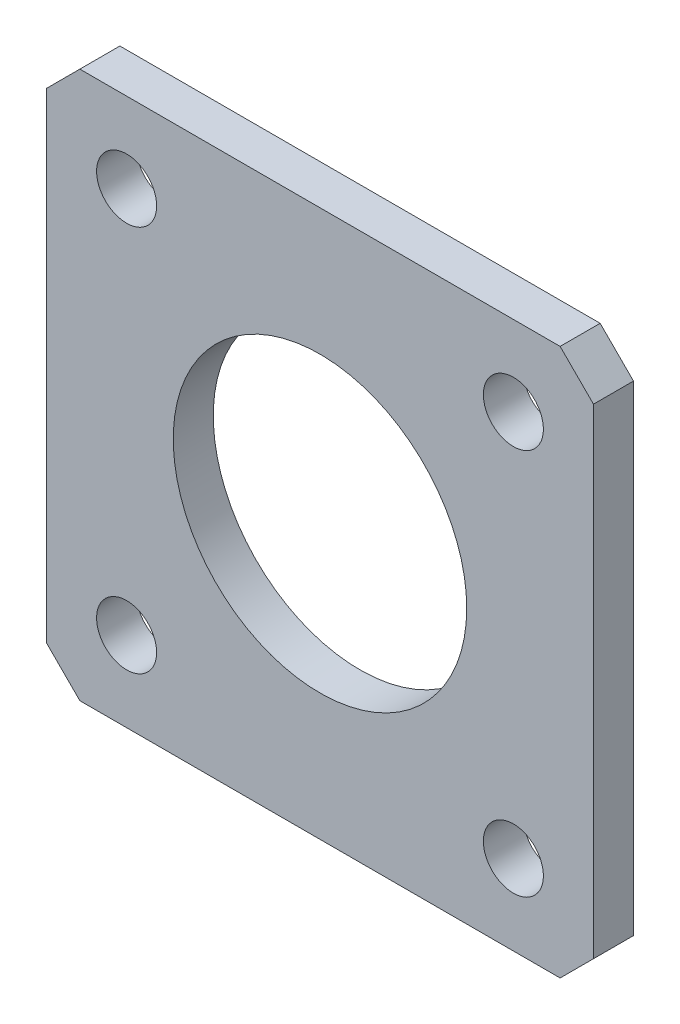
ISO-10303-21;
HEADER;
FILE_DESCRIPTION(('STEP AP214'),'2;1');
FILE_NAME('part.step','',(''),(''),'','','');
FILE_SCHEMA(('AUTOMOTIVE_DESIGN { 1 0 10303 214 1 1 1 1 }'));
ENDSEC;
DATA;
#1=APPLICATION_CONTEXT('core data for automotive mechanical design processes');
#2=APPLICATION_PROTOCOL_DEFINITION('international standard','automotive_design',2000,#1);
#3=PRODUCT_CONTEXT('',#1,'mechanical');
#4=PRODUCT('Part','Part','',(#3));
#5=PRODUCT_RELATED_PRODUCT_CATEGORY('part','',(#4));
#6=PRODUCT_DEFINITION_FORMATION('','',#4);
#7=PRODUCT_DEFINITION_CONTEXT('part definition',#1,'design');
#8=PRODUCT_DEFINITION('design','',#6,#7);
#9=PRODUCT_DEFINITION_SHAPE('','',#8);
#10=(LENGTH_UNIT() NAMED_UNIT(*) SI_UNIT(.MILLI.,.METRE.));
#11=(NAMED_UNIT(*) PLANE_ANGLE_UNIT() SI_UNIT($,.RADIAN.));
#12=(NAMED_UNIT(*) SI_UNIT($,.STERADIAN.) SOLID_ANGLE_UNIT());
#13=UNCERTAINTY_MEASURE_WITH_UNIT(LENGTH_MEASURE(1.E-05),#10,'distance_accuracy_value','');
#14=(GEOMETRIC_REPRESENTATION_CONTEXT(3) GLOBAL_UNCERTAINTY_ASSIGNED_CONTEXT((#13)) GLOBAL_UNIT_ASSIGNED_CONTEXT((#10,
#11,#12)) REPRESENTATION_CONTEXT('',''));
#15=CARTESIAN_POINT('',(0.,0.,0.));
#16=DIRECTION('',(0.,0.,1.));
#17=DIRECTION('',(1.,0.,0.));
#18=AXIS2_PLACEMENT_3D('',#15,#16,#17);
#19=CARTESIAN_POINT('',(20.5,20.5,3.));
#20=DIRECTION('',(0.,0.,-1.));
#21=DIRECTION('',(-1.,0.,0.));
#22=AXIS2_PLACEMENT_3D('',#19,#20,#21);
#23=PLANE('',#22);
#24=CARTESIAN_POINT('',(-14.4956890143242,-14.4956890143242,3.));
#25=DIRECTION('',(0.,0.,1.));
#26=DIRECTION('',(1.,0.,0.));
#27=AXIS2_PLACEMENT_3D('',#24,#25,#26);
#28=CIRCLE('',#27,2.25);
#29=CARTESIAN_POINT('',(-12.2456890143242,-14.4956890143242,3.));
#30=VERTEX_POINT('',#29);
#31=EDGE_CURVE('E204',#30,#30,#28,.T.);
#32=ORIENTED_EDGE('',*,*,#31,.F.);
#33=EDGE_LOOP('',(#32));
#34=FACE_BOUND('',#33,.T.);
#35=CARTESIAN_POINT('',(14.4956890143242,-14.4956890143242,3.));
#36=DIRECTION('',(0.,0.,1.));
#37=DIRECTION('',(1.,0.,0.));
#38=AXIS2_PLACEMENT_3D('',#35,#36,#37);
#39=CIRCLE('',#38,2.25);
#40=CARTESIAN_POINT('',(16.7456890143242,-14.4956890143242,3.));
#41=VERTEX_POINT('',#40);
#42=EDGE_CURVE('E198',#41,#41,#39,.T.);
#43=ORIENTED_EDGE('',*,*,#42,.F.);
#44=EDGE_LOOP('',(#43));
#45=FACE_BOUND('',#44,.T.);
#46=CARTESIAN_POINT('',(14.4956890143242,14.4956890143242,3.));
#47=DIRECTION('',(0.,0.,1.));
#48=DIRECTION('',(1.,0.,0.));
#49=AXIS2_PLACEMENT_3D('',#46,#47,#48);
#50=CIRCLE('',#49,2.25);
#51=CARTESIAN_POINT('',(16.7456890143242,14.4956890143242,3.));
#52=VERTEX_POINT('',#51);
#53=EDGE_CURVE('E192',#52,#52,#50,.T.);
#54=ORIENTED_EDGE('',*,*,#53,.F.);
#55=EDGE_LOOP('',(#54));
#56=FACE_BOUND('',#55,.T.);
#57=CARTESIAN_POINT('',(-14.4956890143242,14.4956890143242,3.));
#58=DIRECTION('',(0.,0.,1.));
#59=DIRECTION('',(1.,0.,0.));
#60=AXIS2_PLACEMENT_3D('',#57,#58,#59);
#61=CIRCLE('',#60,2.25);
#62=CARTESIAN_POINT('',(-12.2456890143242,14.4956890143242,3.));
#63=VERTEX_POINT('',#62);
#64=EDGE_CURVE('E186',#63,#63,#61,.T.);
#65=ORIENTED_EDGE('',*,*,#64,.F.);
#66=EDGE_LOOP('',(#65));
#67=FACE_BOUND('',#66,.T.);
#68=DIRECTION('',(-1.,0.,0.));
#69=VECTOR('',#68,1.);
#70=CARTESIAN_POINT('',(-20.5,20.5,3.));
#71=LINE('',#70,#69);
#72=CARTESIAN_POINT('',(18.,20.5,3.));
#73=VERTEX_POINT('',#72);
#74=CARTESIAN_POINT('',(-18.,20.5,3.));
#75=VERTEX_POINT('',#74);
#76=EDGE_CURVE('E170',#73,#75,#71,.T.);
#77=ORIENTED_EDGE('',*,*,#76,.T.);
#78=DIRECTION('',(0.707106781186549,0.707106781186546,0.));
#79=VECTOR('',#78,1.);
#80=CARTESIAN_POINT('',(-20.5,18.,3.));
#81=LINE('',#80,#79);
#82=CARTESIAN_POINT('',(-20.5,18.,3.));
#83=VERTEX_POINT('',#82);
#84=EDGE_CURVE('E148',#75,#83,#81,.F.);
#85=ORIENTED_EDGE('',*,*,#84,.T.);
#86=DIRECTION('',(0.,-1.,0.));
#87=VECTOR('',#86,1.);
#88=CARTESIAN_POINT('',(-20.5,-20.5,3.));
#89=LINE('',#88,#87);
#90=CARTESIAN_POINT('',(-20.5,-18.,3.));
#91=VERTEX_POINT('',#90);
#92=EDGE_CURVE('E118',#83,#91,#89,.T.);
#93=ORIENTED_EDGE('',*,*,#92,.T.);
#94=DIRECTION('',(-0.707106781186546,0.707106781186549,0.));
#95=VECTOR('',#94,1.);
#96=CARTESIAN_POINT('',(-18.,-20.5,3.));
#97=LINE('',#96,#95);
#98=CARTESIAN_POINT('',(-18.,-20.5,3.));
#99=VERTEX_POINT('',#98);
#100=EDGE_CURVE('E54',#91,#99,#97,.F.);
#101=ORIENTED_EDGE('',*,*,#100,.T.);
#102=DIRECTION('',(1.,0.,0.));
#103=VECTOR('',#102,1.);
#104=CARTESIAN_POINT('',(-20.5,-20.5,3.));
#105=LINE('',#104,#103);
#106=CARTESIAN_POINT('',(18.,-20.5,3.));
#107=VERTEX_POINT('',#106);
#108=EDGE_CURVE('E134',#99,#107,#105,.T.);
#109=ORIENTED_EDGE('',*,*,#108,.T.);
#110=DIRECTION('',(-0.707106781186549,-0.707106781186546,0.));
#111=VECTOR('',#110,1.);
#112=CARTESIAN_POINT('',(20.5,-18.,3.));
#113=LINE('',#112,#111);
#114=CARTESIAN_POINT('',(20.5,-18.,3.));
#115=VERTEX_POINT('',#114);
#116=EDGE_CURVE('E144',#107,#115,#113,.F.);
#117=ORIENTED_EDGE('',*,*,#116,.T.);
#118=DIRECTION('',(0.,1.,0.));
#119=VECTOR('',#118,1.);
#120=CARTESIAN_POINT('',(20.5,-20.5,3.));
#121=LINE('',#120,#119);
#122=CARTESIAN_POINT('',(20.5,18.,3.));
#123=VERTEX_POINT('',#122);
#124=EDGE_CURVE('E128',#115,#123,#121,.T.);
#125=ORIENTED_EDGE('',*,*,#124,.T.);
#126=DIRECTION('',(0.707106781186546,-0.707106781186549,0.));
#127=VECTOR('',#126,1.);
#128=CARTESIAN_POINT('',(18.,20.5,3.));
#129=LINE('',#128,#127);
#130=EDGE_CURVE('E146',#123,#73,#129,.F.);
#131=ORIENTED_EDGE('',*,*,#130,.T.);
#132=EDGE_LOOP('',(#77,#85,#93,#101,#109,#117,#125,#131));
#133=FACE_BOUND('',#132,.T.);
#134=CARTESIAN_POINT('',(0.,0.,3.));
#135=DIRECTION('',(0.,0.,1.));
#136=DIRECTION('',(1.,0.,0.));
#137=AXIS2_PLACEMENT_3D('',#134,#135,#136);
#138=CIRCLE('',#137,11.);
#139=CARTESIAN_POINT('',(11.,0.,3.));
#140=VERTEX_POINT('',#139);
#141=EDGE_CURVE('E179',#140,#140,#138,.T.);
#142=ORIENTED_EDGE('',*,*,#141,.F.);
#143=EDGE_LOOP('',(#142));
#144=FACE_BOUND('',#143,.T.);
#145=ADVANCED_FACE('F34',(#34,#45,#56,#67,#133,#144),#23,.F.);
#146=CARTESIAN_POINT('',(20.5,20.5,0.));
#147=DIRECTION('',(0.,0.,-1.));
#148=DIRECTION('',(-1.,0.,0.));
#149=AXIS2_PLACEMENT_3D('',#146,#147,#148);
#150=PLANE('',#149);
#151=CARTESIAN_POINT('',(-14.4956890143242,-14.4956890143242,0.));
#152=DIRECTION('',(0.,0.,1.));
#153=DIRECTION('',(1.,0.,0.));
#154=AXIS2_PLACEMENT_3D('',#151,#152,#153);
#155=CIRCLE('',#154,2.25);
#156=CARTESIAN_POINT('',(-12.2456890143242,-14.4956890143242,0.));
#157=VERTEX_POINT('',#156);
#158=EDGE_CURVE('E201',#157,#157,#155,.T.);
#159=ORIENTED_EDGE('',*,*,#158,.T.);
#160=EDGE_LOOP('',(#159));
#161=FACE_BOUND('',#160,.T.);
#162=CARTESIAN_POINT('',(14.4956890143242,-14.4956890143242,0.));
#163=DIRECTION('',(0.,0.,1.));
#164=DIRECTION('',(1.,0.,0.));
#165=AXIS2_PLACEMENT_3D('',#162,#163,#164);
#166=CIRCLE('',#165,2.25);
#167=CARTESIAN_POINT('',(16.7456890143242,-14.4956890143242,0.));
#168=VERTEX_POINT('',#167);
#169=EDGE_CURVE('E195',#168,#168,#166,.T.);
#170=ORIENTED_EDGE('',*,*,#169,.T.);
#171=EDGE_LOOP('',(#170));
#172=FACE_BOUND('',#171,.T.);
#173=CARTESIAN_POINT('',(14.4956890143242,14.4956890143242,0.));
#174=DIRECTION('',(0.,0.,1.));
#175=DIRECTION('',(1.,0.,0.));
#176=AXIS2_PLACEMENT_3D('',#173,#174,#175);
#177=CIRCLE('',#176,2.25);
#178=CARTESIAN_POINT('',(16.7456890143242,14.4956890143242,0.));
#179=VERTEX_POINT('',#178);
#180=EDGE_CURVE('E189',#179,#179,#177,.T.);
#181=ORIENTED_EDGE('',*,*,#180,.T.);
#182=EDGE_LOOP('',(#181));
#183=FACE_BOUND('',#182,.T.);
#184=CARTESIAN_POINT('',(-14.4956890143242,14.4956890143242,0.));
#185=DIRECTION('',(0.,0.,1.));
#186=DIRECTION('',(1.,0.,0.));
#187=AXIS2_PLACEMENT_3D('',#184,#185,#186);
#188=CIRCLE('',#187,2.25);
#189=CARTESIAN_POINT('',(-12.2456890143242,14.4956890143242,0.));
#190=VERTEX_POINT('',#189);
#191=EDGE_CURVE('E184',#190,#190,#188,.T.);
#192=ORIENTED_EDGE('',*,*,#191,.T.);
#193=EDGE_LOOP('',(#192));
#194=FACE_BOUND('',#193,.T.);
#195=DIRECTION('',(0.,-1.,0.));
#196=VECTOR('',#195,1.);
#197=CARTESIAN_POINT('',(-20.5,-20.5,0.));
#198=LINE('',#197,#196);
#199=CARTESIAN_POINT('',(-20.5,18.,0.));
#200=VERTEX_POINT('',#199);
#201=CARTESIAN_POINT('',(-20.5,-18.,0.));
#202=VERTEX_POINT('',#201);
#203=EDGE_CURVE('E116',#200,#202,#198,.T.);
#204=ORIENTED_EDGE('',*,*,#203,.F.);
#205=DIRECTION('',(-0.707106781186549,-0.707106781186546,0.));
#206=VECTOR('',#205,1.);
#207=CARTESIAN_POINT('',(1.25000000000008,39.75,0.));
#208=LINE('',#207,#206);
#209=CARTESIAN_POINT('',(-18.,20.5,0.));
#210=VERTEX_POINT('',#209);
#211=EDGE_CURVE('E99',#200,#210,#208,.F.);
#212=ORIENTED_EDGE('',*,*,#211,.T.);
#213=DIRECTION('',(-1.,0.,0.));
#214=VECTOR('',#213,1.);
#215=CARTESIAN_POINT('',(-20.5,20.5,0.));
#216=LINE('',#215,#214);
#217=CARTESIAN_POINT('',(18.,20.5,0.));
#218=VERTEX_POINT('',#217);
#219=EDGE_CURVE('E126',#218,#210,#216,.T.);
#220=ORIENTED_EDGE('',*,*,#219,.F.);
#221=DIRECTION('',(-0.707106781186546,0.707106781186549,0.));
#222=VECTOR('',#221,1.);
#223=CARTESIAN_POINT('',(19.25,19.25,0.));
#224=LINE('',#223,#222);
#225=CARTESIAN_POINT('',(20.5,18.,0.));
#226=VERTEX_POINT('',#225);
#227=EDGE_CURVE('E110',#218,#226,#224,.F.);
#228=ORIENTED_EDGE('',*,*,#227,.T.);
#229=DIRECTION('',(0.,1.,0.));
#230=VECTOR('',#229,1.);
#231=CARTESIAN_POINT('',(20.5,-20.5,0.));
#232=LINE('',#231,#230);
#233=CARTESIAN_POINT('',(20.5,-18.,0.));
#234=VERTEX_POINT('',#233);
#235=EDGE_CURVE('E130',#234,#226,#232,.T.);
#236=ORIENTED_EDGE('',*,*,#235,.F.);
#237=DIRECTION('',(0.707106781186549,0.707106781186546,0.));
#238=VECTOR('',#237,1.);
#239=CARTESIAN_POINT('',(39.75,1.24999999999986,0.));
#240=LINE('',#239,#238);
#241=CARTESIAN_POINT('',(18.,-20.5,0.));
#242=VERTEX_POINT('',#241);
#243=EDGE_CURVE('E137',#234,#242,#240,.F.);
#244=ORIENTED_EDGE('',*,*,#243,.T.);
#245=DIRECTION('',(1.,0.,0.));
#246=VECTOR('',#245,1.);
#247=CARTESIAN_POINT('',(-20.5,-20.5,0.));
#248=LINE('',#247,#246);
#249=CARTESIAN_POINT('',(-18.,-20.5,0.));
#250=VERTEX_POINT('',#249);
#251=EDGE_CURVE('E125',#250,#242,#248,.T.);
#252=ORIENTED_EDGE('',*,*,#251,.F.);
#253=DIRECTION('',(0.707106781186546,-0.707106781186549,0.));
#254=VECTOR('',#253,1.);
#255=CARTESIAN_POINT('',(-19.2500000000001,-19.2499999999999,0.));
#256=LINE('',#255,#254);
#257=EDGE_CURVE('E119',#250,#202,#256,.F.);
#258=ORIENTED_EDGE('',*,*,#257,.T.);
#259=EDGE_LOOP('',(#204,#212,#220,#228,#236,#244,#252,#258));
#260=FACE_BOUND('',#259,.T.);
#261=CARTESIAN_POINT('',(0.,0.,0.));
#262=DIRECTION('',(0.,0.,1.));
#263=DIRECTION('',(1.,0.,0.));
#264=AXIS2_PLACEMENT_3D('',#261,#262,#263);
#265=CIRCLE('',#264,11.);
#266=CARTESIAN_POINT('',(11.,0.,0.));
#267=VERTEX_POINT('',#266);
#268=EDGE_CURVE('E175',#267,#267,#265,.T.);
#269=ORIENTED_EDGE('',*,*,#268,.T.);
#270=EDGE_LOOP('',(#269));
#271=FACE_BOUND('',#270,.T.);
#272=ADVANCED_FACE('F122',(#161,#172,#183,#194,#260,#271),#150,.T.);
#273=CARTESIAN_POINT('',(20.5,-20.5,3.));
#274=DIRECTION('',(-1.,0.,0.));
#275=DIRECTION('',(0.,0.,1.));
#276=AXIS2_PLACEMENT_3D('',#273,#274,#275);
#277=PLANE('',#276);
#278=ORIENTED_EDGE('',*,*,#235,.T.);
#279=DIRECTION('',(0.,0.,1.));
#280=VECTOR('',#279,1.);
#281=CARTESIAN_POINT('',(20.5,18.,3.));
#282=LINE('',#281,#280);
#283=EDGE_CURVE('E153',#226,#123,#282,.T.);
#284=ORIENTED_EDGE('',*,*,#283,.T.);
#285=ORIENTED_EDGE('',*,*,#124,.F.);
#286=DIRECTION('',(0.,0.,-1.));
#287=VECTOR('',#286,1.);
#288=CARTESIAN_POINT('',(20.5,-18.,3.));
#289=LINE('',#288,#287);
#290=EDGE_CURVE('E150',#115,#234,#289,.T.);
#291=ORIENTED_EDGE('',*,*,#290,.T.);
#292=EDGE_LOOP('',(#278,#284,#285,#291));
#293=FACE_BOUND('',#292,.T.);
#294=ADVANCED_FACE('F166',(#293),#277,.F.);
#295=CARTESIAN_POINT('',(-20.5,20.5,3.));
#296=DIRECTION('',(0.,-1.,0.));
#297=DIRECTION('',(0.,0.,-1.));
#298=AXIS2_PLACEMENT_3D('',#295,#296,#297);
#299=PLANE('',#298);
#300=ORIENTED_EDGE('',*,*,#219,.T.);
#301=DIRECTION('',(0.,0.,1.));
#302=VECTOR('',#301,1.);
#303=CARTESIAN_POINT('',(-18.,20.5,3.));
#304=LINE('',#303,#302);
#305=EDGE_CURVE('E104',#210,#75,#304,.T.);
#306=ORIENTED_EDGE('',*,*,#305,.T.);
#307=ORIENTED_EDGE('',*,*,#76,.F.);
#308=DIRECTION('',(0.,0.,-1.));
#309=VECTOR('',#308,1.);
#310=CARTESIAN_POINT('',(18.,20.5,3.));
#311=LINE('',#310,#309);
#312=EDGE_CURVE('E109',#73,#218,#311,.T.);
#313=ORIENTED_EDGE('',*,*,#312,.T.);
#314=EDGE_LOOP('',(#300,#306,#307,#313));
#315=FACE_BOUND('',#314,.T.);
#316=ADVANCED_FACE('F231',(#315),#299,.F.);
#317=CARTESIAN_POINT('',(-20.5,-20.5,3.));
#318=DIRECTION('',(1.,0.,0.));
#319=DIRECTION('',(0.,0.,-1.));
#320=AXIS2_PLACEMENT_3D('',#317,#318,#319);
#321=PLANE('',#320);
#322=ORIENTED_EDGE('',*,*,#92,.F.);
#323=DIRECTION('',(0.,0.,-1.));
#324=VECTOR('',#323,1.);
#325=CARTESIAN_POINT('',(-20.5,18.,3.));
#326=LINE('',#325,#324);
#327=EDGE_CURVE('E103',#83,#200,#326,.T.);
#328=ORIENTED_EDGE('',*,*,#327,.T.);
#329=ORIENTED_EDGE('',*,*,#203,.T.);
#330=DIRECTION('',(0.,0.,1.));
#331=VECTOR('',#330,1.);
#332=CARTESIAN_POINT('',(-20.5,-18.,3.));
#333=LINE('',#332,#331);
#334=EDGE_CURVE('E120',#202,#91,#333,.T.);
#335=ORIENTED_EDGE('',*,*,#334,.T.);
#336=EDGE_LOOP('',(#322,#328,#329,#335));
#337=FACE_BOUND('',#336,.T.);
#338=ADVANCED_FACE('F115',(#337),#321,.F.);
#339=CARTESIAN_POINT('',(-20.5,-20.5,3.));
#340=DIRECTION('',(0.,1.,0.));
#341=DIRECTION('',(0.,0.,1.));
#342=AXIS2_PLACEMENT_3D('',#339,#340,#341);
#343=PLANE('',#342);
#344=ORIENTED_EDGE('',*,*,#251,.T.);
#345=DIRECTION('',(0.,0.,1.));
#346=VECTOR('',#345,1.);
#347=CARTESIAN_POINT('',(18.,-20.5,3.));
#348=LINE('',#347,#346);
#349=EDGE_CURVE('E11',#242,#107,#348,.T.);
#350=ORIENTED_EDGE('',*,*,#349,.T.);
#351=ORIENTED_EDGE('',*,*,#108,.F.);
#352=DIRECTION('',(0.,0.,-1.));
#353=VECTOR('',#352,1.);
#354=CARTESIAN_POINT('',(-18.,-20.5,3.));
#355=LINE('',#354,#353);
#356=EDGE_CURVE('E42',#99,#250,#355,.T.);
#357=ORIENTED_EDGE('',*,*,#356,.T.);
#358=EDGE_LOOP('',(#344,#350,#351,#357));
#359=FACE_BOUND('',#358,.T.);
#360=ADVANCED_FACE('F156',(#359),#343,.F.);
#361=CARTESIAN_POINT('',(0.,0.,3.));
#362=DIRECTION('',(0.,0.,-1.));
#363=DIRECTION('',(-1.,0.,0.));
#364=AXIS2_PLACEMENT_3D('',#361,#362,#363);
#365=CYLINDRICAL_SURFACE('',#364,11.);
#366=ORIENTED_EDGE('',*,*,#141,.T.);
#367=EDGE_LOOP('',(#366));
#368=FACE_BOUND('',#367,.T.);
#369=ORIENTED_EDGE('',*,*,#268,.F.);
#370=EDGE_LOOP('',(#369));
#371=FACE_BOUND('',#370,.T.);
#372=ADVANCED_FACE('F250',(#368,#371),#365,.F.);
#373=CARTESIAN_POINT('',(-14.4956890143242,14.4956890143242,0.));
#374=DIRECTION('',(0.,0.,1.));
#375=DIRECTION('',(1.,0.,0.));
#376=AXIS2_PLACEMENT_3D('',#373,#374,#375);
#377=CYLINDRICAL_SURFACE('',#376,2.25);
#378=ORIENTED_EDGE('',*,*,#191,.F.);
#379=EDGE_LOOP('',(#378));
#380=FACE_BOUND('',#379,.T.);
#381=ORIENTED_EDGE('',*,*,#64,.T.);
#382=EDGE_LOOP('',(#381));
#383=FACE_BOUND('',#382,.T.);
#384=ADVANCED_FACE('F255',(#380,#383),#377,.F.);
#385=CARTESIAN_POINT('',(14.4956890143242,14.4956890143242,0.));
#386=DIRECTION('',(0.,0.,1.));
#387=DIRECTION('',(1.,0.,0.));
#388=AXIS2_PLACEMENT_3D('',#385,#386,#387);
#389=CYLINDRICAL_SURFACE('',#388,2.25);
#390=ORIENTED_EDGE('',*,*,#180,.F.);
#391=EDGE_LOOP('',(#390));
#392=FACE_BOUND('',#391,.T.);
#393=ORIENTED_EDGE('',*,*,#53,.T.);
#394=EDGE_LOOP('',(#393));
#395=FACE_BOUND('',#394,.T.);
#396=ADVANCED_FACE('F258',(#392,#395),#389,.F.);
#397=CARTESIAN_POINT('',(14.4956890143242,-14.4956890143242,0.));
#398=DIRECTION('',(0.,0.,1.));
#399=DIRECTION('',(1.,0.,0.));
#400=AXIS2_PLACEMENT_3D('',#397,#398,#399);
#401=CYLINDRICAL_SURFACE('',#400,2.25);
#402=ORIENTED_EDGE('',*,*,#169,.F.);
#403=EDGE_LOOP('',(#402));
#404=FACE_BOUND('',#403,.T.);
#405=ORIENTED_EDGE('',*,*,#42,.T.);
#406=EDGE_LOOP('',(#405));
#407=FACE_BOUND('',#406,.T.);
#408=ADVANCED_FACE('F215',(#404,#407),#401,.F.);
#409=CARTESIAN_POINT('',(-14.4956890143242,-14.4956890143242,0.));
#410=DIRECTION('',(0.,0.,1.));
#411=DIRECTION('',(1.,0.,0.));
#412=AXIS2_PLACEMENT_3D('',#409,#410,#411);
#413=CYLINDRICAL_SURFACE('',#412,2.25);
#414=ORIENTED_EDGE('',*,*,#158,.F.);
#415=EDGE_LOOP('',(#414));
#416=FACE_BOUND('',#415,.T.);
#417=ORIENTED_EDGE('',*,*,#31,.T.);
#418=EDGE_LOOP('',(#417));
#419=FACE_BOUND('',#418,.T.);
#420=ADVANCED_FACE('F212',(#416,#419),#413,.F.);
#421=CARTESIAN_POINT('',(-20.5,18.,3.));
#422=DIRECTION('',(0.707106781186546,-0.707106781186549,0.));
#423=DIRECTION('',(0.707106781186549,0.707106781186546,0.));
#424=AXIS2_PLACEMENT_3D('',#421,#422,#423);
#425=PLANE('',#424);
#426=ORIENTED_EDGE('',*,*,#84,.F.);
#427=ORIENTED_EDGE('',*,*,#305,.F.);
#428=ORIENTED_EDGE('',*,*,#211,.F.);
#429=ORIENTED_EDGE('',*,*,#327,.F.);
#430=EDGE_LOOP('',(#426,#427,#428,#429));
#431=FACE_BOUND('',#430,.T.);
#432=ADVANCED_FACE('F102',(#431),#425,.F.);
#433=CARTESIAN_POINT('',(18.,20.5,3.));
#434=DIRECTION('',(-0.707106781186549,-0.707106781186546,0.));
#435=DIRECTION('',(0.707106781186546,-0.707106781186549,0.));
#436=AXIS2_PLACEMENT_3D('',#433,#434,#435);
#437=PLANE('',#436);
#438=ORIENTED_EDGE('',*,*,#130,.F.);
#439=ORIENTED_EDGE('',*,*,#283,.F.);
#440=ORIENTED_EDGE('',*,*,#227,.F.);
#441=ORIENTED_EDGE('',*,*,#312,.F.);
#442=EDGE_LOOP('',(#438,#439,#440,#441));
#443=FACE_BOUND('',#442,.T.);
#444=ADVANCED_FACE('F233',(#443),#437,.F.);
#445=CARTESIAN_POINT('',(20.5,-18.,3.));
#446=DIRECTION('',(-0.707106781186546,0.707106781186549,0.));
#447=DIRECTION('',(-0.707106781186549,-0.707106781186546,0.));
#448=AXIS2_PLACEMENT_3D('',#445,#446,#447);
#449=PLANE('',#448);
#450=ORIENTED_EDGE('',*,*,#116,.F.);
#451=ORIENTED_EDGE('',*,*,#349,.F.);
#452=ORIENTED_EDGE('',*,*,#243,.F.);
#453=ORIENTED_EDGE('',*,*,#290,.F.);
#454=EDGE_LOOP('',(#450,#451,#452,#453));
#455=FACE_BOUND('',#454,.T.);
#456=ADVANCED_FACE('F163',(#455),#449,.F.);
#457=CARTESIAN_POINT('',(-18.,-20.5,3.));
#458=DIRECTION('',(0.707106781186549,0.707106781186546,0.));
#459=DIRECTION('',(-0.707106781186546,0.707106781186549,0.));
#460=AXIS2_PLACEMENT_3D('',#457,#458,#459);
#461=PLANE('',#460);
#462=ORIENTED_EDGE('',*,*,#100,.F.);
#463=ORIENTED_EDGE('',*,*,#334,.F.);
#464=ORIENTED_EDGE('',*,*,#257,.F.);
#465=ORIENTED_EDGE('',*,*,#356,.F.);
#466=EDGE_LOOP('',(#462,#463,#464,#465));
#467=FACE_BOUND('',#466,.T.);
#468=ADVANCED_FACE('F36',(#467),#461,.F.);
#469=CLOSED_SHELL('',(#145,#272,#294,#316,#338,#360,#372,#384,#396,#408,#420,#432,#444,#456,#468));
#470=MANIFOLD_SOLID_BREP('B2',#469);
#471=ADVANCED_BREP_SHAPE_REPRESENTATION('',(#18,#470),#14);
#472=SHAPE_DEFINITION_REPRESENTATION(#9,#471);
ENDSEC;
END-ISO-10303-21;
